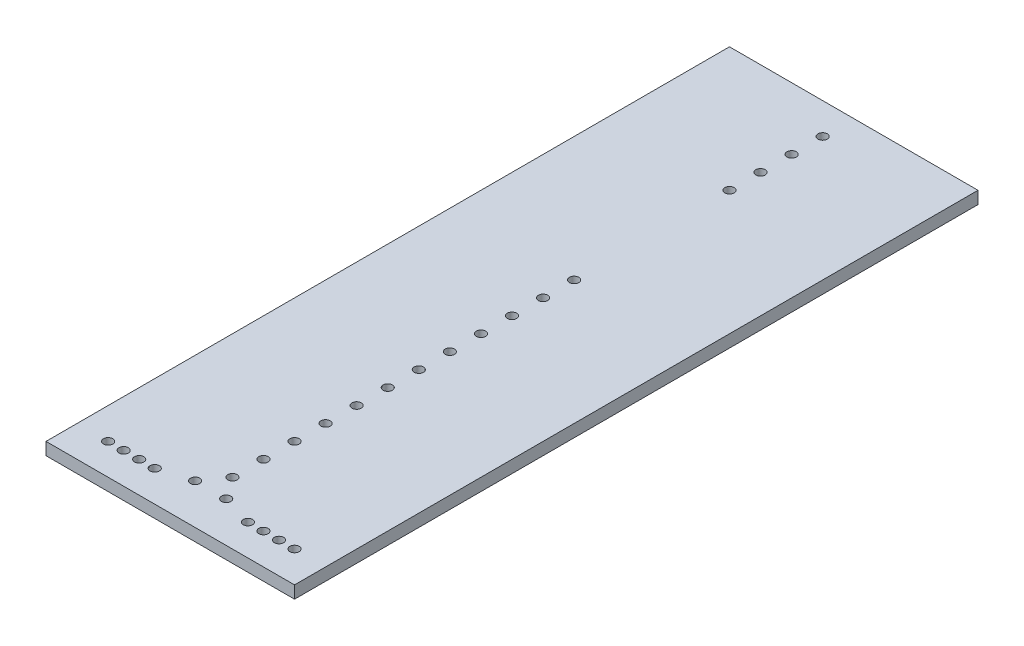
ISO-10303-21;
HEADER;
FILE_DESCRIPTION(('STEP AP214'),'2;1');
FILE_NAME('part.step','',(''),(''),'','','');
FILE_SCHEMA(('AUTOMOTIVE_DESIGN { 1 0 10303 214 1 1 1 1 }'));
ENDSEC;
DATA;
#1=APPLICATION_CONTEXT('core data for automotive mechanical design processes');
#2=APPLICATION_PROTOCOL_DEFINITION('international standard','automotive_design',2000,#1);
#3=PRODUCT_CONTEXT('',#1,'mechanical');
#4=PRODUCT('Part','Part','',(#3));
#5=PRODUCT_RELATED_PRODUCT_CATEGORY('part','',(#4));
#6=PRODUCT_DEFINITION_FORMATION('','',#4);
#7=PRODUCT_DEFINITION_CONTEXT('part definition',#1,'design');
#8=PRODUCT_DEFINITION('design','',#6,#7);
#9=PRODUCT_DEFINITION_SHAPE('','',#8);
#10=(LENGTH_UNIT() NAMED_UNIT(*) SI_UNIT(.MILLI.,.METRE.));
#11=(NAMED_UNIT(*) PLANE_ANGLE_UNIT() SI_UNIT($,.RADIAN.));
#12=(NAMED_UNIT(*) SI_UNIT($,.STERADIAN.) SOLID_ANGLE_UNIT());
#13=UNCERTAINTY_MEASURE_WITH_UNIT(LENGTH_MEASURE(1.E-05),#10,'distance_accuracy_value','');
#14=(GEOMETRIC_REPRESENTATION_CONTEXT(3) GLOBAL_UNCERTAINTY_ASSIGNED_CONTEXT((#13)) GLOBAL_UNIT_ASSIGNED_CONTEXT((#10,
#11,#12)) REPRESENTATION_CONTEXT('',''));
#15=CARTESIAN_POINT('',(0.,0.,0.));
#16=DIRECTION('',(0.,0.,1.));
#17=DIRECTION('',(1.,0.,0.));
#18=AXIS2_PLACEMENT_3D('',#15,#16,#17);
#19=CARTESIAN_POINT('',(40.,4.,110.));
#20=DIRECTION('',(-1.,0.,0.));
#21=DIRECTION('',(0.,0.,1.));
#22=AXIS2_PLACEMENT_3D('',#19,#20,#21);
#23=PLANE('',#22);
#24=DIRECTION('',(0.,0.,-1.));
#25=VECTOR('',#24,1.);
#26=CARTESIAN_POINT('',(40.,0.,110.));
#27=LINE('',#26,#25);
#28=CARTESIAN_POINT('',(40.,0.,110.));
#29=VERTEX_POINT('',#28);
#30=CARTESIAN_POINT('',(40.,0.,-110.));
#31=VERTEX_POINT('',#30);
#32=EDGE_CURVE('E96',#29,#31,#27,.T.);
#33=ORIENTED_EDGE('',*,*,#32,.T.);
#34=DIRECTION('',(0.,-1.,0.));
#35=VECTOR('',#34,1.);
#36=CARTESIAN_POINT('',(40.,4.,-110.));
#37=LINE('',#36,#35);
#38=CARTESIAN_POINT('',(40.,4.,-110.));
#39=VERTEX_POINT('',#38);
#40=EDGE_CURVE('E11',#39,#31,#37,.T.);
#41=ORIENTED_EDGE('',*,*,#40,.F.);
#42=DIRECTION('',(0.,0.,-1.));
#43=VECTOR('',#42,1.);
#44=CARTESIAN_POINT('',(40.,4.,110.));
#45=LINE('',#44,#43);
#46=CARTESIAN_POINT('',(40.,4.,110.));
#47=VERTEX_POINT('',#46);
#48=EDGE_CURVE('E84',#47,#39,#45,.T.);
#49=ORIENTED_EDGE('',*,*,#48,.F.);
#50=DIRECTION('',(0.,-1.,0.));
#51=VECTOR('',#50,1.);
#52=CARTESIAN_POINT('',(40.,4.,110.));
#53=LINE('',#52,#51);
#54=EDGE_CURVE('E92',#47,#29,#53,.T.);
#55=ORIENTED_EDGE('',*,*,#54,.T.);
#56=EDGE_LOOP('',(#33,#41,#49,#55));
#57=FACE_BOUND('',#56,.T.);
#58=ADVANCED_FACE('F33',(#57),#23,.F.);
#59=CARTESIAN_POINT('',(-40.,4.,-110.));
#60=DIRECTION('',(0.,0.,1.));
#61=DIRECTION('',(1.,0.,0.));
#62=AXIS2_PLACEMENT_3D('',#59,#60,#61);
#63=PLANE('',#62);
#64=DIRECTION('',(-1.,0.,0.));
#65=VECTOR('',#64,1.);
#66=CARTESIAN_POINT('',(-40.,0.,-110.));
#67=LINE('',#66,#65);
#68=CARTESIAN_POINT('',(-40.,0.,-110.));
#69=VERTEX_POINT('',#68);
#70=EDGE_CURVE('E88',#31,#69,#67,.T.);
#71=ORIENTED_EDGE('',*,*,#70,.T.);
#72=DIRECTION('',(0.,-1.,0.));
#73=VECTOR('',#72,1.);
#74=CARTESIAN_POINT('',(-40.,4.,-110.));
#75=LINE('',#74,#73);
#76=CARTESIAN_POINT('',(-40.,4.,-110.));
#77=VERTEX_POINT('',#76);
#78=EDGE_CURVE('E41',#77,#69,#75,.T.);
#79=ORIENTED_EDGE('',*,*,#78,.F.);
#80=DIRECTION('',(-1.,0.,0.));
#81=VECTOR('',#80,1.);
#82=CARTESIAN_POINT('',(-40.,4.,-110.));
#83=LINE('',#82,#81);
#84=EDGE_CURVE('E79',#39,#77,#83,.T.);
#85=ORIENTED_EDGE('',*,*,#84,.F.);
#86=ORIENTED_EDGE('',*,*,#40,.T.);
#87=EDGE_LOOP('',(#71,#79,#85,#86));
#88=FACE_BOUND('',#87,.T.);
#89=ADVANCED_FACE('F87',(#88),#63,.F.);
#90=CARTESIAN_POINT('',(-40.,4.,110.));
#91=DIRECTION('',(1.,0.,0.));
#92=DIRECTION('',(0.,0.,-1.));
#93=AXIS2_PLACEMENT_3D('',#90,#91,#92);
#94=PLANE('',#93);
#95=DIRECTION('',(0.,0.,1.));
#96=VECTOR('',#95,1.);
#97=CARTESIAN_POINT('',(-40.,0.,110.));
#98=LINE('',#97,#96);
#99=CARTESIAN_POINT('',(-40.,0.,110.));
#100=VERTEX_POINT('',#99);
#101=EDGE_CURVE('E66',#69,#100,#98,.T.);
#102=ORIENTED_EDGE('',*,*,#101,.T.);
#103=DIRECTION('',(0.,-1.,0.));
#104=VECTOR('',#103,1.);
#105=CARTESIAN_POINT('',(-40.,4.,110.));
#106=LINE('',#105,#104);
#107=CARTESIAN_POINT('',(-40.,4.,110.));
#108=VERTEX_POINT('',#107);
#109=EDGE_CURVE('E89',#108,#100,#106,.T.);
#110=ORIENTED_EDGE('',*,*,#109,.F.);
#111=DIRECTION('',(0.,0.,1.));
#112=VECTOR('',#111,1.);
#113=CARTESIAN_POINT('',(-40.,4.,110.));
#114=LINE('',#113,#112);
#115=EDGE_CURVE('E82',#77,#108,#114,.T.);
#116=ORIENTED_EDGE('',*,*,#115,.F.);
#117=ORIENTED_EDGE('',*,*,#78,.T.);
#118=EDGE_LOOP('',(#102,#110,#116,#117));
#119=FACE_BOUND('',#118,.T.);
#120=ADVANCED_FACE('F90',(#119),#94,.F.);
#121=CARTESIAN_POINT('',(-40.,4.,110.));
#122=DIRECTION('',(0.,0.,-1.));
#123=DIRECTION('',(-1.,0.,0.));
#124=AXIS2_PLACEMENT_3D('',#121,#122,#123);
#125=PLANE('',#124);
#126=DIRECTION('',(1.,0.,0.));
#127=VECTOR('',#126,1.);
#128=CARTESIAN_POINT('',(-40.,0.,110.));
#129=LINE('',#128,#127);
#130=EDGE_CURVE('E72',#100,#29,#129,.T.);
#131=ORIENTED_EDGE('',*,*,#130,.T.);
#132=ORIENTED_EDGE('',*,*,#54,.F.);
#133=DIRECTION('',(1.,0.,0.));
#134=VECTOR('',#133,1.);
#135=CARTESIAN_POINT('',(-40.,4.,110.));
#136=LINE('',#135,#134);
#137=EDGE_CURVE('E49',#108,#47,#136,.T.);
#138=ORIENTED_EDGE('',*,*,#137,.F.);
#139=ORIENTED_EDGE('',*,*,#109,.T.);
#140=EDGE_LOOP('',(#131,#132,#138,#139));
#141=FACE_BOUND('',#140,.T.);
#142=ADVANCED_FACE('F104',(#141),#125,.F.);
#143=CARTESIAN_POINT('',(0.,4.,0.));
#144=DIRECTION('',(0.,-1.,0.));
#145=DIRECTION('',(0.,0.,-1.));
#146=AXIS2_PLACEMENT_3D('',#143,#144,#145);
#147=PLANE('',#146);
#148=CARTESIAN_POINT('',(0.,4.,-70.));
#149=DIRECTION('',(0.,1.,0.));
#150=DIRECTION('',(0.,0.,1.));
#151=AXIS2_PLACEMENT_3D('',#148,#149,#150);
#152=CIRCLE('',#151,1.5);
#153=CARTESIAN_POINT('',(0.,4.,-68.5));
#154=VERTEX_POINT('',#153);
#155=EDGE_CURVE('E260',#154,#154,#152,.T.);
#156=ORIENTED_EDGE('',*,*,#155,.F.);
#157=EDGE_LOOP('',(#156));
#158=FACE_BOUND('',#157,.T.);
#159=CARTESIAN_POINT('',(0.,4.,-80.));
#160=DIRECTION('',(0.,1.,0.));
#161=DIRECTION('',(0.,0.,1.));
#162=AXIS2_PLACEMENT_3D('',#159,#160,#161);
#163=CIRCLE('',#162,1.5);
#164=CARTESIAN_POINT('',(0.,4.,-78.5));
#165=VERTEX_POINT('',#164);
#166=EDGE_CURVE('E254',#165,#165,#163,.T.);
#167=ORIENTED_EDGE('',*,*,#166,.F.);
#168=EDGE_LOOP('',(#167));
#169=FACE_BOUND('',#168,.T.);
#170=CARTESIAN_POINT('',(0.,4.,-90.));
#171=DIRECTION('',(0.,1.,0.));
#172=DIRECTION('',(0.,0.,1.));
#173=AXIS2_PLACEMENT_3D('',#170,#171,#172);
#174=CIRCLE('',#173,1.5);
#175=CARTESIAN_POINT('',(0.,4.,-88.5));
#176=VERTEX_POINT('',#175);
#177=EDGE_CURVE('E248',#176,#176,#174,.T.);
#178=ORIENTED_EDGE('',*,*,#177,.F.);
#179=EDGE_LOOP('',(#178));
#180=FACE_BOUND('',#179,.T.);
#181=CARTESIAN_POINT('',(0.,4.,-100.));
#182=DIRECTION('',(0.,1.,0.));
#183=DIRECTION('',(0.,0.,1.));
#184=AXIS2_PLACEMENT_3D('',#181,#182,#183);
#185=CIRCLE('',#184,1.5);
#186=CARTESIAN_POINT('',(0.,4.,-98.5));
#187=VERTEX_POINT('',#186);
#188=EDGE_CURVE('E242',#187,#187,#185,.T.);
#189=ORIENTED_EDGE('',*,*,#188,.F.);
#190=EDGE_LOOP('',(#189));
#191=FACE_BOUND('',#190,.T.);
#192=CARTESIAN_POINT('',(-5.00000000000003,4.,97.0000000000001));
#193=DIRECTION('',(0.,-1.,0.));
#194=DIRECTION('',(0.,0.,1.));
#195=AXIS2_PLACEMENT_3D('',#192,#193,#194);
#196=CIRCLE('',#195,1.5);
#197=CARTESIAN_POINT('',(-5.00000000000003,4.,98.5000000000001));
#198=VERTEX_POINT('',#197);
#199=EDGE_CURVE('E236',#198,#198,#196,.T.);
#200=ORIENTED_EDGE('',*,*,#199,.T.);
#201=EDGE_LOOP('',(#200));
#202=FACE_BOUND('',#201,.T.);
#203=CARTESIAN_POINT('',(5.00000000000003,4.,97.0000000000001));
#204=DIRECTION('',(0.,1.,0.));
#205=DIRECTION('',(0.,0.,1.));
#206=AXIS2_PLACEMENT_3D('',#203,#204,#205);
#207=CIRCLE('',#206,1.5);
#208=CARTESIAN_POINT('',(5.00000000000003,4.,98.5000000000001));
#209=VERTEX_POINT('',#208);
#210=EDGE_CURVE('E230',#209,#209,#207,.T.);
#211=ORIENTED_EDGE('',*,*,#210,.F.);
#212=EDGE_LOOP('',(#211));
#213=FACE_BOUND('',#212,.T.);
#214=CARTESIAN_POINT('',(0.,4.,90.));
#215=DIRECTION('',(0.,1.,0.));
#216=DIRECTION('',(0.,0.,1.));
#217=AXIS2_PLACEMENT_3D('',#214,#215,#216);
#218=CIRCLE('',#217,1.5);
#219=CARTESIAN_POINT('',(0.,4.,91.5));
#220=VERTEX_POINT('',#219);
#221=EDGE_CURVE('E225',#220,#220,#218,.T.);
#222=ORIENTED_EDGE('',*,*,#221,.F.);
#223=EDGE_LOOP('',(#222));
#224=FACE_BOUND('',#223,.T.);
#225=CARTESIAN_POINT('',(0.,4.,80.));
#226=DIRECTION('',(0.,1.,0.));
#227=DIRECTION('',(0.,0.,1.));
#228=AXIS2_PLACEMENT_3D('',#225,#226,#227);
#229=CIRCLE('',#228,1.5);
#230=CARTESIAN_POINT('',(0.,4.,81.5));
#231=VERTEX_POINT('',#230);
#232=EDGE_CURVE('E219',#231,#231,#229,.T.);
#233=ORIENTED_EDGE('',*,*,#232,.F.);
#234=EDGE_LOOP('',(#233));
#235=FACE_BOUND('',#234,.T.);
#236=CARTESIAN_POINT('',(0.,4.,70.));
#237=DIRECTION('',(0.,1.,0.));
#238=DIRECTION('',(0.,0.,1.));
#239=AXIS2_PLACEMENT_3D('',#236,#237,#238);
#240=CIRCLE('',#239,1.5);
#241=CARTESIAN_POINT('',(0.,4.,71.5));
#242=VERTEX_POINT('',#241);
#243=EDGE_CURVE('E213',#242,#242,#240,.T.);
#244=ORIENTED_EDGE('',*,*,#243,.F.);
#245=EDGE_LOOP('',(#244));
#246=FACE_BOUND('',#245,.T.);
#247=CARTESIAN_POINT('',(0.,4.,60.));
#248=DIRECTION('',(0.,1.,0.));
#249=DIRECTION('',(0.,0.,1.));
#250=AXIS2_PLACEMENT_3D('',#247,#248,#249);
#251=CIRCLE('',#250,1.5);
#252=CARTESIAN_POINT('',(0.,4.,61.5));
#253=VERTEX_POINT('',#252);
#254=EDGE_CURVE('E207',#253,#253,#251,.T.);
#255=ORIENTED_EDGE('',*,*,#254,.F.);
#256=EDGE_LOOP('',(#255));
#257=FACE_BOUND('',#256,.T.);
#258=CARTESIAN_POINT('',(0.,4.,50.));
#259=DIRECTION('',(0.,1.,0.));
#260=DIRECTION('',(0.,0.,1.));
#261=AXIS2_PLACEMENT_3D('',#258,#259,#260);
#262=CIRCLE('',#261,1.5);
#263=CARTESIAN_POINT('',(0.,4.,51.5));
#264=VERTEX_POINT('',#263);
#265=EDGE_CURVE('E201',#264,#264,#262,.T.);
#266=ORIENTED_EDGE('',*,*,#265,.F.);
#267=EDGE_LOOP('',(#266));
#268=FACE_BOUND('',#267,.T.);
#269=CARTESIAN_POINT('',(0.,4.,40.));
#270=DIRECTION('',(0.,1.,0.));
#271=DIRECTION('',(0.,0.,1.));
#272=AXIS2_PLACEMENT_3D('',#269,#270,#271);
#273=CIRCLE('',#272,1.5);
#274=CARTESIAN_POINT('',(0.,4.,41.5));
#275=VERTEX_POINT('',#274);
#276=EDGE_CURVE('E195',#275,#275,#273,.T.);
#277=ORIENTED_EDGE('',*,*,#276,.F.);
#278=EDGE_LOOP('',(#277));
#279=FACE_BOUND('',#278,.T.);
#280=CARTESIAN_POINT('',(0.,4.,30.));
#281=DIRECTION('',(0.,1.,0.));
#282=DIRECTION('',(0.,0.,1.));
#283=AXIS2_PLACEMENT_3D('',#280,#281,#282);
#284=CIRCLE('',#283,1.5);
#285=CARTESIAN_POINT('',(0.,4.,31.5));
#286=VERTEX_POINT('',#285);
#287=EDGE_CURVE('E189',#286,#286,#284,.T.);
#288=ORIENTED_EDGE('',*,*,#287,.F.);
#289=EDGE_LOOP('',(#288));
#290=FACE_BOUND('',#289,.T.);
#291=CARTESIAN_POINT('',(0.,4.,20.));
#292=DIRECTION('',(0.,1.,0.));
#293=DIRECTION('',(0.,0.,1.));
#294=AXIS2_PLACEMENT_3D('',#291,#292,#293);
#295=CIRCLE('',#294,1.5);
#296=CARTESIAN_POINT('',(0.,4.,21.5));
#297=VERTEX_POINT('',#296);
#298=EDGE_CURVE('E183',#297,#297,#295,.T.);
#299=ORIENTED_EDGE('',*,*,#298,.F.);
#300=EDGE_LOOP('',(#299));
#301=FACE_BOUND('',#300,.T.);
#302=CARTESIAN_POINT('',(0.,4.,9.99999999999999));
#303=DIRECTION('',(0.,1.,0.));
#304=DIRECTION('',(0.,0.,1.));
#305=AXIS2_PLACEMENT_3D('',#302,#303,#304);
#306=CIRCLE('',#305,1.5);
#307=CARTESIAN_POINT('',(0.,4.,11.5));
#308=VERTEX_POINT('',#307);
#309=EDGE_CURVE('E177',#308,#308,#306,.T.);
#310=ORIENTED_EDGE('',*,*,#309,.F.);
#311=EDGE_LOOP('',(#310));
#312=FACE_BOUND('',#311,.T.);
#313=CARTESIAN_POINT('',(0.,4.,0.));
#314=DIRECTION('',(0.,1.,0.));
#315=DIRECTION('',(0.,0.,1.));
#316=AXIS2_PLACEMENT_3D('',#313,#314,#315);
#317=CIRCLE('',#316,1.5);
#318=CARTESIAN_POINT('',(0.,4.,1.5));
#319=VERTEX_POINT('',#318);
#320=EDGE_CURVE('E171',#319,#319,#317,.T.);
#321=ORIENTED_EDGE('',*,*,#320,.F.);
#322=EDGE_LOOP('',(#321));
#323=FACE_BOUND('',#322,.T.);
#324=CARTESIAN_POINT('',(0.,4.,-10.));
#325=DIRECTION('',(0.,1.,0.));
#326=DIRECTION('',(0.,0.,1.));
#327=AXIS2_PLACEMENT_3D('',#324,#325,#326);
#328=CIRCLE('',#327,1.5);
#329=CARTESIAN_POINT('',(0.,4.,-8.50000000000001));
#330=VERTEX_POINT('',#329);
#331=EDGE_CURVE('E165',#330,#330,#328,.T.);
#332=ORIENTED_EDGE('',*,*,#331,.F.);
#333=EDGE_LOOP('',(#332));
#334=FACE_BOUND('',#333,.T.);
#335=CARTESIAN_POINT('',(0.,4.,-20.));
#336=DIRECTION('',(0.,1.,0.));
#337=DIRECTION('',(0.,0.,1.));
#338=AXIS2_PLACEMENT_3D('',#335,#336,#337);
#339=CIRCLE('',#338,1.5);
#340=CARTESIAN_POINT('',(0.,4.,-18.5));
#341=VERTEX_POINT('',#340);
#342=EDGE_CURVE('E158',#341,#341,#339,.T.);
#343=ORIENTED_EDGE('',*,*,#342,.F.);
#344=EDGE_LOOP('',(#343));
#345=FACE_BOUND('',#344,.T.);
#346=CARTESIAN_POINT('',(-30.,4.,100.));
#347=DIRECTION('',(0.,-1.,0.));
#348=DIRECTION('',(0.,0.,1.));
#349=AXIS2_PLACEMENT_3D('',#346,#347,#348);
#350=CIRCLE('',#349,1.5);
#351=CARTESIAN_POINT('',(-30.,4.,101.5));
#352=VERTEX_POINT('',#351);
#353=EDGE_CURVE('E153',#352,#352,#350,.T.);
#354=ORIENTED_EDGE('',*,*,#353,.T.);
#355=EDGE_LOOP('',(#354));
#356=FACE_BOUND('',#355,.T.);
#357=CARTESIAN_POINT('',(-25.,4.,100.));
#358=DIRECTION('',(0.,-1.,0.));
#359=DIRECTION('',(0.,0.,1.));
#360=AXIS2_PLACEMENT_3D('',#357,#358,#359);
#361=CIRCLE('',#360,1.5);
#362=CARTESIAN_POINT('',(-25.,4.,101.5));
#363=VERTEX_POINT('',#362);
#364=EDGE_CURVE('E147',#363,#363,#361,.T.);
#365=ORIENTED_EDGE('',*,*,#364,.T.);
#366=EDGE_LOOP('',(#365));
#367=FACE_BOUND('',#366,.T.);
#368=CARTESIAN_POINT('',(-20.,4.,100.));
#369=DIRECTION('',(0.,-1.,0.));
#370=DIRECTION('',(0.,0.,1.));
#371=AXIS2_PLACEMENT_3D('',#368,#369,#370);
#372=CIRCLE('',#371,1.5);
#373=CARTESIAN_POINT('',(-20.,4.,101.5));
#374=VERTEX_POINT('',#373);
#375=EDGE_CURVE('E141',#374,#374,#372,.T.);
#376=ORIENTED_EDGE('',*,*,#375,.T.);
#377=EDGE_LOOP('',(#376));
#378=FACE_BOUND('',#377,.T.);
#379=CARTESIAN_POINT('',(-15.,4.,100.));
#380=DIRECTION('',(0.,-1.,0.));
#381=DIRECTION('',(0.,0.,1.));
#382=AXIS2_PLACEMENT_3D('',#379,#380,#381);
#383=CIRCLE('',#382,1.5);
#384=CARTESIAN_POINT('',(-15.,4.,101.5));
#385=VERTEX_POINT('',#384);
#386=EDGE_CURVE('E134',#385,#385,#383,.T.);
#387=ORIENTED_EDGE('',*,*,#386,.T.);
#388=EDGE_LOOP('',(#387));
#389=FACE_BOUND('',#388,.T.);
#390=CARTESIAN_POINT('',(30.,4.,100.));
#391=DIRECTION('',(0.,1.,0.));
#392=DIRECTION('',(0.,0.,1.));
#393=AXIS2_PLACEMENT_3D('',#390,#391,#392);
#394=CIRCLE('',#393,1.5);
#395=CARTESIAN_POINT('',(30.,4.,101.5));
#396=VERTEX_POINT('',#395);
#397=EDGE_CURVE('E129',#396,#396,#394,.T.);
#398=ORIENTED_EDGE('',*,*,#397,.F.);
#399=EDGE_LOOP('',(#398));
#400=FACE_BOUND('',#399,.T.);
#401=CARTESIAN_POINT('',(25.,4.,100.));
#402=DIRECTION('',(0.,1.,0.));
#403=DIRECTION('',(0.,0.,1.));
#404=AXIS2_PLACEMENT_3D('',#401,#402,#403);
#405=CIRCLE('',#404,1.5);
#406=CARTESIAN_POINT('',(25.,4.,101.5));
#407=VERTEX_POINT('',#406);
#408=EDGE_CURVE('E123',#407,#407,#405,.T.);
#409=ORIENTED_EDGE('',*,*,#408,.F.);
#410=EDGE_LOOP('',(#409));
#411=FACE_BOUND('',#410,.T.);
#412=CARTESIAN_POINT('',(20.,4.,100.));
#413=DIRECTION('',(0.,1.,0.));
#414=DIRECTION('',(0.,0.,1.));
#415=AXIS2_PLACEMENT_3D('',#412,#413,#414);
#416=CIRCLE('',#415,1.5);
#417=CARTESIAN_POINT('',(20.,4.,101.5));
#418=VERTEX_POINT('',#417);
#419=EDGE_CURVE('E117',#418,#418,#416,.T.);
#420=ORIENTED_EDGE('',*,*,#419,.F.);
#421=EDGE_LOOP('',(#420));
#422=FACE_BOUND('',#421,.T.);
#423=CARTESIAN_POINT('',(15.,4.,100.));
#424=DIRECTION('',(0.,1.,0.));
#425=DIRECTION('',(0.,0.,1.));
#426=AXIS2_PLACEMENT_3D('',#423,#424,#425);
#427=CIRCLE('',#426,1.5);
#428=CARTESIAN_POINT('',(15.,4.,101.5));
#429=VERTEX_POINT('',#428);
#430=EDGE_CURVE('E110',#429,#429,#427,.T.);
#431=ORIENTED_EDGE('',*,*,#430,.F.);
#432=EDGE_LOOP('',(#431));
#433=FACE_BOUND('',#432,.T.);
#434=ORIENTED_EDGE('',*,*,#48,.T.);
#435=ORIENTED_EDGE('',*,*,#84,.T.);
#436=ORIENTED_EDGE('',*,*,#115,.T.);
#437=ORIENTED_EDGE('',*,*,#137,.T.);
#438=EDGE_LOOP('',(#434,#435,#436,#437));
#439=FACE_BOUND('',#438,.T.);
#440=ADVANCED_FACE('F80',(#158,#169,#180,#191,#202,#213,#224,#235,#246,#257,#268,#279,#290,#301,
#312,#323,#334,#345,#356,#367,#378,#389,#400,#411,#422,#433,#439),#147,.F.);
#441=CARTESIAN_POINT('',(0.,0.,0.));
#442=DIRECTION('',(0.,-1.,0.));
#443=DIRECTION('',(0.,0.,-1.));
#444=AXIS2_PLACEMENT_3D('',#441,#442,#443);
#445=PLANE('',#444);
#446=CARTESIAN_POINT('',(0.,0.,-70.));
#447=DIRECTION('',(0.,1.,0.));
#448=DIRECTION('',(0.,0.,1.));
#449=AXIS2_PLACEMENT_3D('',#446,#447,#448);
#450=CIRCLE('',#449,1.5);
#451=CARTESIAN_POINT('',(0.,0.,-68.5));
#452=VERTEX_POINT('',#451);
#453=EDGE_CURVE('E239',#452,#452,#450,.T.);
#454=ORIENTED_EDGE('',*,*,#453,.T.);
#455=EDGE_LOOP('',(#454));
#456=FACE_BOUND('',#455,.T.);
#457=CARTESIAN_POINT('',(0.,0.,-80.));
#458=DIRECTION('',(0.,1.,0.));
#459=DIRECTION('',(0.,0.,1.));
#460=AXIS2_PLACEMENT_3D('',#457,#458,#459);
#461=CIRCLE('',#460,1.5);
#462=CARTESIAN_POINT('',(0.,0.,-78.5));
#463=VERTEX_POINT('',#462);
#464=EDGE_CURVE('E257',#463,#463,#461,.T.);
#465=ORIENTED_EDGE('',*,*,#464,.T.);
#466=EDGE_LOOP('',(#465));
#467=FACE_BOUND('',#466,.T.);
#468=CARTESIAN_POINT('',(0.,0.,-90.));
#469=DIRECTION('',(0.,1.,0.));
#470=DIRECTION('',(0.,0.,1.));
#471=AXIS2_PLACEMENT_3D('',#468,#469,#470);
#472=CIRCLE('',#471,1.5);
#473=CARTESIAN_POINT('',(0.,0.,-88.5));
#474=VERTEX_POINT('',#473);
#475=EDGE_CURVE('E251',#474,#474,#472,.T.);
#476=ORIENTED_EDGE('',*,*,#475,.T.);
#477=EDGE_LOOP('',(#476));
#478=FACE_BOUND('',#477,.T.);
#479=CARTESIAN_POINT('',(0.,0.,-100.));
#480=DIRECTION('',(0.,1.,0.));
#481=DIRECTION('',(0.,0.,1.));
#482=AXIS2_PLACEMENT_3D('',#479,#480,#481);
#483=CIRCLE('',#482,1.5);
#484=CARTESIAN_POINT('',(0.,0.,-98.5));
#485=VERTEX_POINT('',#484);
#486=EDGE_CURVE('E245',#485,#485,#483,.T.);
#487=ORIENTED_EDGE('',*,*,#486,.T.);
#488=EDGE_LOOP('',(#487));
#489=FACE_BOUND('',#488,.T.);
#490=CARTESIAN_POINT('',(-5.00000000000003,0.,97.0000000000001));
#491=DIRECTION('',(0.,-1.,0.));
#492=DIRECTION('',(0.,0.,1.));
#493=AXIS2_PLACEMENT_3D('',#490,#491,#492);
#494=CIRCLE('',#493,1.5);
#495=CARTESIAN_POINT('',(-5.00000000000003,0.,98.5000000000001));
#496=VERTEX_POINT('',#495);
#497=EDGE_CURVE('E233',#496,#496,#494,.T.);
#498=ORIENTED_EDGE('',*,*,#497,.F.);
#499=EDGE_LOOP('',(#498));
#500=FACE_BOUND('',#499,.T.);
#501=CARTESIAN_POINT('',(5.00000000000003,0.,97.0000000000001));
#502=DIRECTION('',(0.,1.,0.));
#503=DIRECTION('',(0.,0.,1.));
#504=AXIS2_PLACEMENT_3D('',#501,#502,#503);
#505=CIRCLE('',#504,1.5);
#506=CARTESIAN_POINT('',(5.00000000000003,0.,98.5000000000001));
#507=VERTEX_POINT('',#506);
#508=EDGE_CURVE('E162',#507,#507,#505,.T.);
#509=ORIENTED_EDGE('',*,*,#508,.T.);
#510=EDGE_LOOP('',(#509));
#511=FACE_BOUND('',#510,.T.);
#512=CARTESIAN_POINT('',(0.,0.,90.));
#513=DIRECTION('',(0.,1.,0.));
#514=DIRECTION('',(0.,0.,1.));
#515=AXIS2_PLACEMENT_3D('',#512,#513,#514);
#516=CIRCLE('',#515,1.5);
#517=CARTESIAN_POINT('',(0.,0.,91.5));
#518=VERTEX_POINT('',#517);
#519=EDGE_CURVE('E138',#518,#518,#516,.T.);
#520=ORIENTED_EDGE('',*,*,#519,.T.);
#521=EDGE_LOOP('',(#520));
#522=FACE_BOUND('',#521,.T.);
#523=CARTESIAN_POINT('',(0.,0.,80.));
#524=DIRECTION('',(0.,1.,0.));
#525=DIRECTION('',(0.,0.,1.));
#526=AXIS2_PLACEMENT_3D('',#523,#524,#525);
#527=CIRCLE('',#526,1.5);
#528=CARTESIAN_POINT('',(0.,0.,81.5));
#529=VERTEX_POINT('',#528);
#530=EDGE_CURVE('E222',#529,#529,#527,.T.);
#531=ORIENTED_EDGE('',*,*,#530,.T.);
#532=EDGE_LOOP('',(#531));
#533=FACE_BOUND('',#532,.T.);
#534=CARTESIAN_POINT('',(0.,0.,70.));
#535=DIRECTION('',(0.,1.,0.));
#536=DIRECTION('',(0.,0.,1.));
#537=AXIS2_PLACEMENT_3D('',#534,#535,#536);
#538=CIRCLE('',#537,1.5);
#539=CARTESIAN_POINT('',(0.,0.,71.5));
#540=VERTEX_POINT('',#539);
#541=EDGE_CURVE('E216',#540,#540,#538,.T.);
#542=ORIENTED_EDGE('',*,*,#541,.T.);
#543=EDGE_LOOP('',(#542));
#544=FACE_BOUND('',#543,.T.);
#545=CARTESIAN_POINT('',(0.,0.,60.));
#546=DIRECTION('',(0.,1.,0.));
#547=DIRECTION('',(0.,0.,1.));
#548=AXIS2_PLACEMENT_3D('',#545,#546,#547);
#549=CIRCLE('',#548,1.5);
#550=CARTESIAN_POINT('',(0.,0.,61.5));
#551=VERTEX_POINT('',#550);
#552=EDGE_CURVE('E210',#551,#551,#549,.T.);
#553=ORIENTED_EDGE('',*,*,#552,.T.);
#554=EDGE_LOOP('',(#553));
#555=FACE_BOUND('',#554,.T.);
#556=CARTESIAN_POINT('',(0.,0.,50.));
#557=DIRECTION('',(0.,1.,0.));
#558=DIRECTION('',(0.,0.,1.));
#559=AXIS2_PLACEMENT_3D('',#556,#557,#558);
#560=CIRCLE('',#559,1.5);
#561=CARTESIAN_POINT('',(0.,0.,51.5));
#562=VERTEX_POINT('',#561);
#563=EDGE_CURVE('E204',#562,#562,#560,.T.);
#564=ORIENTED_EDGE('',*,*,#563,.T.);
#565=EDGE_LOOP('',(#564));
#566=FACE_BOUND('',#565,.T.);
#567=CARTESIAN_POINT('',(0.,0.,40.));
#568=DIRECTION('',(0.,1.,0.));
#569=DIRECTION('',(0.,0.,1.));
#570=AXIS2_PLACEMENT_3D('',#567,#568,#569);
#571=CIRCLE('',#570,1.5);
#572=CARTESIAN_POINT('',(0.,0.,41.5));
#573=VERTEX_POINT('',#572);
#574=EDGE_CURVE('E198',#573,#573,#571,.T.);
#575=ORIENTED_EDGE('',*,*,#574,.T.);
#576=EDGE_LOOP('',(#575));
#577=FACE_BOUND('',#576,.T.);
#578=CARTESIAN_POINT('',(0.,0.,30.));
#579=DIRECTION('',(0.,1.,0.));
#580=DIRECTION('',(0.,0.,1.));
#581=AXIS2_PLACEMENT_3D('',#578,#579,#580);
#582=CIRCLE('',#581,1.5);
#583=CARTESIAN_POINT('',(0.,0.,31.5));
#584=VERTEX_POINT('',#583);
#585=EDGE_CURVE('E192',#584,#584,#582,.T.);
#586=ORIENTED_EDGE('',*,*,#585,.T.);
#587=EDGE_LOOP('',(#586));
#588=FACE_BOUND('',#587,.T.);
#589=CARTESIAN_POINT('',(0.,0.,20.));
#590=DIRECTION('',(0.,1.,0.));
#591=DIRECTION('',(0.,0.,1.));
#592=AXIS2_PLACEMENT_3D('',#589,#590,#591);
#593=CIRCLE('',#592,1.5);
#594=CARTESIAN_POINT('',(0.,0.,21.5));
#595=VERTEX_POINT('',#594);
#596=EDGE_CURVE('E186',#595,#595,#593,.T.);
#597=ORIENTED_EDGE('',*,*,#596,.T.);
#598=EDGE_LOOP('',(#597));
#599=FACE_BOUND('',#598,.T.);
#600=CARTESIAN_POINT('',(0.,0.,9.99999999999999));
#601=DIRECTION('',(0.,1.,0.));
#602=DIRECTION('',(0.,0.,1.));
#603=AXIS2_PLACEMENT_3D('',#600,#601,#602);
#604=CIRCLE('',#603,1.5);
#605=CARTESIAN_POINT('',(0.,0.,11.5));
#606=VERTEX_POINT('',#605);
#607=EDGE_CURVE('E180',#606,#606,#604,.T.);
#608=ORIENTED_EDGE('',*,*,#607,.T.);
#609=EDGE_LOOP('',(#608));
#610=FACE_BOUND('',#609,.T.);
#611=CARTESIAN_POINT('',(0.,0.,0.));
#612=DIRECTION('',(0.,1.,0.));
#613=DIRECTION('',(0.,0.,1.));
#614=AXIS2_PLACEMENT_3D('',#611,#612,#613);
#615=CIRCLE('',#614,1.5);
#616=CARTESIAN_POINT('',(0.,0.,1.5));
#617=VERTEX_POINT('',#616);
#618=EDGE_CURVE('E174',#617,#617,#615,.T.);
#619=ORIENTED_EDGE('',*,*,#618,.T.);
#620=EDGE_LOOP('',(#619));
#621=FACE_BOUND('',#620,.T.);
#622=CARTESIAN_POINT('',(0.,0.,-10.));
#623=DIRECTION('',(0.,1.,0.));
#624=DIRECTION('',(0.,0.,1.));
#625=AXIS2_PLACEMENT_3D('',#622,#623,#624);
#626=CIRCLE('',#625,1.5);
#627=CARTESIAN_POINT('',(0.,0.,-8.50000000000001));
#628=VERTEX_POINT('',#627);
#629=EDGE_CURVE('E168',#628,#628,#626,.T.);
#630=ORIENTED_EDGE('',*,*,#629,.T.);
#631=EDGE_LOOP('',(#630));
#632=FACE_BOUND('',#631,.T.);
#633=CARTESIAN_POINT('',(0.,0.,-20.));
#634=DIRECTION('',(0.,1.,0.));
#635=DIRECTION('',(0.,0.,1.));
#636=AXIS2_PLACEMENT_3D('',#633,#634,#635);
#637=CIRCLE('',#636,1.5);
#638=CARTESIAN_POINT('',(0.,0.,-18.5));
#639=VERTEX_POINT('',#638);
#640=EDGE_CURVE('E161',#639,#639,#637,.T.);
#641=ORIENTED_EDGE('',*,*,#640,.T.);
#642=EDGE_LOOP('',(#641));
#643=FACE_BOUND('',#642,.T.);
#644=CARTESIAN_POINT('',(-30.,0.,100.));
#645=DIRECTION('',(0.,-1.,0.));
#646=DIRECTION('',(0.,0.,1.));
#647=AXIS2_PLACEMENT_3D('',#644,#645,#646);
#648=CIRCLE('',#647,1.5);
#649=CARTESIAN_POINT('',(-30.,0.,101.5));
#650=VERTEX_POINT('',#649);
#651=EDGE_CURVE('E114',#650,#650,#648,.T.);
#652=ORIENTED_EDGE('',*,*,#651,.F.);
#653=EDGE_LOOP('',(#652));
#654=FACE_BOUND('',#653,.T.);
#655=CARTESIAN_POINT('',(-25.,0.,100.));
#656=DIRECTION('',(0.,-1.,0.));
#657=DIRECTION('',(0.,0.,1.));
#658=AXIS2_PLACEMENT_3D('',#655,#656,#657);
#659=CIRCLE('',#658,1.5);
#660=CARTESIAN_POINT('',(-25.,0.,101.5));
#661=VERTEX_POINT('',#660);
#662=EDGE_CURVE('E150',#661,#661,#659,.T.);
#663=ORIENTED_EDGE('',*,*,#662,.F.);
#664=EDGE_LOOP('',(#663));
#665=FACE_BOUND('',#664,.T.);
#666=CARTESIAN_POINT('',(-20.,0.,100.));
#667=DIRECTION('',(0.,-1.,0.));
#668=DIRECTION('',(0.,0.,1.));
#669=AXIS2_PLACEMENT_3D('',#666,#667,#668);
#670=CIRCLE('',#669,1.5);
#671=CARTESIAN_POINT('',(-20.,0.,101.5));
#672=VERTEX_POINT('',#671);
#673=EDGE_CURVE('E144',#672,#672,#670,.T.);
#674=ORIENTED_EDGE('',*,*,#673,.F.);
#675=EDGE_LOOP('',(#674));
#676=FACE_BOUND('',#675,.T.);
#677=CARTESIAN_POINT('',(-15.,0.,100.));
#678=DIRECTION('',(0.,-1.,0.));
#679=DIRECTION('',(0.,0.,1.));
#680=AXIS2_PLACEMENT_3D('',#677,#678,#679);
#681=CIRCLE('',#680,1.5);
#682=CARTESIAN_POINT('',(-15.,0.,101.5));
#683=VERTEX_POINT('',#682);
#684=EDGE_CURVE('E137',#683,#683,#681,.T.);
#685=ORIENTED_EDGE('',*,*,#684,.F.);
#686=EDGE_LOOP('',(#685));
#687=FACE_BOUND('',#686,.T.);
#688=CARTESIAN_POINT('',(30.,0.,100.));
#689=DIRECTION('',(0.,1.,0.));
#690=DIRECTION('',(0.,0.,1.));
#691=AXIS2_PLACEMENT_3D('',#688,#689,#690);
#692=CIRCLE('',#691,1.5);
#693=CARTESIAN_POINT('',(30.,0.,101.5));
#694=VERTEX_POINT('',#693);
#695=EDGE_CURVE('E99',#694,#694,#692,.T.);
#696=ORIENTED_EDGE('',*,*,#695,.T.);
#697=EDGE_LOOP('',(#696));
#698=FACE_BOUND('',#697,.T.);
#699=CARTESIAN_POINT('',(25.,0.,100.));
#700=DIRECTION('',(0.,1.,0.));
#701=DIRECTION('',(0.,0.,1.));
#702=AXIS2_PLACEMENT_3D('',#699,#700,#701);
#703=CIRCLE('',#702,1.5);
#704=CARTESIAN_POINT('',(25.,0.,101.5));
#705=VERTEX_POINT('',#704);
#706=EDGE_CURVE('E126',#705,#705,#703,.T.);
#707=ORIENTED_EDGE('',*,*,#706,.T.);
#708=EDGE_LOOP('',(#707));
#709=FACE_BOUND('',#708,.T.);
#710=CARTESIAN_POINT('',(20.,0.,100.));
#711=DIRECTION('',(0.,1.,0.));
#712=DIRECTION('',(0.,0.,1.));
#713=AXIS2_PLACEMENT_3D('',#710,#711,#712);
#714=CIRCLE('',#713,1.5);
#715=CARTESIAN_POINT('',(20.,0.,101.5));
#716=VERTEX_POINT('',#715);
#717=EDGE_CURVE('E120',#716,#716,#714,.T.);
#718=ORIENTED_EDGE('',*,*,#717,.T.);
#719=EDGE_LOOP('',(#718));
#720=FACE_BOUND('',#719,.T.);
#721=CARTESIAN_POINT('',(15.,0.,100.));
#722=DIRECTION('',(0.,1.,0.));
#723=DIRECTION('',(0.,0.,1.));
#724=AXIS2_PLACEMENT_3D('',#721,#722,#723);
#725=CIRCLE('',#724,1.5);
#726=CARTESIAN_POINT('',(15.,0.,101.5));
#727=VERTEX_POINT('',#726);
#728=EDGE_CURVE('E113',#727,#727,#725,.T.);
#729=ORIENTED_EDGE('',*,*,#728,.T.);
#730=EDGE_LOOP('',(#729));
#731=FACE_BOUND('',#730,.T.);
#732=ORIENTED_EDGE('',*,*,#32,.F.);
#733=ORIENTED_EDGE('',*,*,#130,.F.);
#734=ORIENTED_EDGE('',*,*,#101,.F.);
#735=ORIENTED_EDGE('',*,*,#70,.F.);
#736=EDGE_LOOP('',(#732,#733,#734,#735));
#737=FACE_BOUND('',#736,.T.);
#738=ADVANCED_FACE('F107',(#456,#467,#478,#489,#500,#511,#522,#533,#544,#555,#566,#577,#588,
#599,#610,#621,#632,#643,#654,#665,#676,#687,#698,#709,#720,#731,#737),#445,.T.);
#739=CARTESIAN_POINT('',(15.,0.,100.));
#740=DIRECTION('',(0.,1.,0.));
#741=DIRECTION('',(0.,0.,1.));
#742=AXIS2_PLACEMENT_3D('',#739,#740,#741);
#743=CYLINDRICAL_SURFACE('',#742,1.5);
#744=ORIENTED_EDGE('',*,*,#728,.F.);
#745=EDGE_LOOP('',(#744));
#746=FACE_BOUND('',#745,.T.);
#747=ORIENTED_EDGE('',*,*,#430,.T.);
#748=EDGE_LOOP('',(#747));
#749=FACE_BOUND('',#748,.T.);
#750=ADVANCED_FACE('F328',(#746,#749),#743,.F.);
#751=CARTESIAN_POINT('',(20.,0.,100.));
#752=DIRECTION('',(0.,1.,0.));
#753=DIRECTION('',(0.,0.,1.));
#754=AXIS2_PLACEMENT_3D('',#751,#752,#753);
#755=CYLINDRICAL_SURFACE('',#754,1.5);
#756=ORIENTED_EDGE('',*,*,#717,.F.);
#757=EDGE_LOOP('',(#756));
#758=FACE_BOUND('',#757,.T.);
#759=ORIENTED_EDGE('',*,*,#419,.T.);
#760=EDGE_LOOP('',(#759));
#761=FACE_BOUND('',#760,.T.);
#762=ADVANCED_FACE('F330',(#758,#761),#755,.F.);
#763=CARTESIAN_POINT('',(25.,0.,100.));
#764=DIRECTION('',(0.,1.,0.));
#765=DIRECTION('',(0.,0.,1.));
#766=AXIS2_PLACEMENT_3D('',#763,#764,#765);
#767=CYLINDRICAL_SURFACE('',#766,1.5);
#768=ORIENTED_EDGE('',*,*,#706,.F.);
#769=EDGE_LOOP('',(#768));
#770=FACE_BOUND('',#769,.T.);
#771=ORIENTED_EDGE('',*,*,#408,.T.);
#772=EDGE_LOOP('',(#771));
#773=FACE_BOUND('',#772,.T.);
#774=ADVANCED_FACE('F337',(#770,#773),#767,.F.);
#775=CARTESIAN_POINT('',(30.,0.,100.));
#776=DIRECTION('',(0.,1.,0.));
#777=DIRECTION('',(0.,0.,1.));
#778=AXIS2_PLACEMENT_3D('',#775,#776,#777);
#779=CYLINDRICAL_SURFACE('',#778,1.5);
#780=ORIENTED_EDGE('',*,*,#695,.F.);
#781=EDGE_LOOP('',(#780));
#782=FACE_BOUND('',#781,.T.);
#783=ORIENTED_EDGE('',*,*,#397,.T.);
#784=EDGE_LOOP('',(#783));
#785=FACE_BOUND('',#784,.T.);
#786=ADVANCED_FACE('F480',(#782,#785),#779,.F.);
#787=CARTESIAN_POINT('',(-15.,0.,100.));
#788=DIRECTION('',(0.,1.,0.));
#789=DIRECTION('',(0.,0.,1.));
#790=AXIS2_PLACEMENT_3D('',#787,#788,#789);
#791=CYLINDRICAL_SURFACE('',#790,1.5);
#792=ORIENTED_EDGE('',*,*,#684,.T.);
#793=EDGE_LOOP('',(#792));
#794=FACE_BOUND('',#793,.T.);
#795=ORIENTED_EDGE('',*,*,#386,.F.);
#796=EDGE_LOOP('',(#795));
#797=FACE_BOUND('',#796,.T.);
#798=ADVANCED_FACE('F476',(#794,#797),#791,.F.);
#799=CARTESIAN_POINT('',(-20.,0.,100.));
#800=DIRECTION('',(0.,1.,0.));
#801=DIRECTION('',(0.,0.,1.));
#802=AXIS2_PLACEMENT_3D('',#799,#800,#801);
#803=CYLINDRICAL_SURFACE('',#802,1.5);
#804=ORIENTED_EDGE('',*,*,#673,.T.);
#805=EDGE_LOOP('',(#804));
#806=FACE_BOUND('',#805,.T.);
#807=ORIENTED_EDGE('',*,*,#375,.F.);
#808=EDGE_LOOP('',(#807));
#809=FACE_BOUND('',#808,.T.);
#810=ADVANCED_FACE('F472',(#806,#809),#803,.F.);
#811=CARTESIAN_POINT('',(-25.,0.,100.));
#812=DIRECTION('',(0.,1.,0.));
#813=DIRECTION('',(0.,0.,1.));
#814=AXIS2_PLACEMENT_3D('',#811,#812,#813);
#815=CYLINDRICAL_SURFACE('',#814,1.5);
#816=ORIENTED_EDGE('',*,*,#662,.T.);
#817=EDGE_LOOP('',(#816));
#818=FACE_BOUND('',#817,.T.);
#819=ORIENTED_EDGE('',*,*,#364,.F.);
#820=EDGE_LOOP('',(#819));
#821=FACE_BOUND('',#820,.T.);
#822=ADVANCED_FACE('F468',(#818,#821),#815,.F.);
#823=CARTESIAN_POINT('',(-30.,0.,100.));
#824=DIRECTION('',(0.,1.,0.));
#825=DIRECTION('',(0.,0.,1.));
#826=AXIS2_PLACEMENT_3D('',#823,#824,#825);
#827=CYLINDRICAL_SURFACE('',#826,1.5);
#828=ORIENTED_EDGE('',*,*,#651,.T.);
#829=EDGE_LOOP('',(#828));
#830=FACE_BOUND('',#829,.T.);
#831=ORIENTED_EDGE('',*,*,#353,.F.);
#832=EDGE_LOOP('',(#831));
#833=FACE_BOUND('',#832,.T.);
#834=ADVANCED_FACE('F464',(#830,#833),#827,.F.);
#835=CARTESIAN_POINT('',(0.,0.,-20.));
#836=DIRECTION('',(0.,1.,0.));
#837=DIRECTION('',(0.,0.,1.));
#838=AXIS2_PLACEMENT_3D('',#835,#836,#837);
#839=CYLINDRICAL_SURFACE('',#838,1.5);
#840=ORIENTED_EDGE('',*,*,#640,.F.);
#841=EDGE_LOOP('',(#840));
#842=FACE_BOUND('',#841,.T.);
#843=ORIENTED_EDGE('',*,*,#342,.T.);
#844=EDGE_LOOP('',(#843));
#845=FACE_BOUND('',#844,.T.);
#846=ADVANCED_FACE('F460',(#842,#845),#839,.F.);
#847=CARTESIAN_POINT('',(0.,0.,-10.));
#848=DIRECTION('',(0.,1.,0.));
#849=DIRECTION('',(0.,0.,1.));
#850=AXIS2_PLACEMENT_3D('',#847,#848,#849);
#851=CYLINDRICAL_SURFACE('',#850,1.5);
#852=ORIENTED_EDGE('',*,*,#629,.F.);
#853=EDGE_LOOP('',(#852));
#854=FACE_BOUND('',#853,.T.);
#855=ORIENTED_EDGE('',*,*,#331,.T.);
#856=EDGE_LOOP('',(#855));
#857=FACE_BOUND('',#856,.T.);
#858=ADVANCED_FACE('F456',(#854,#857),#851,.F.);
#859=CARTESIAN_POINT('',(0.,0.,0.));
#860=DIRECTION('',(0.,1.,0.));
#861=DIRECTION('',(0.,0.,1.));
#862=AXIS2_PLACEMENT_3D('',#859,#860,#861);
#863=CYLINDRICAL_SURFACE('',#862,1.5);
#864=ORIENTED_EDGE('',*,*,#618,.F.);
#865=EDGE_LOOP('',(#864));
#866=FACE_BOUND('',#865,.T.);
#867=ORIENTED_EDGE('',*,*,#320,.T.);
#868=EDGE_LOOP('',(#867));
#869=FACE_BOUND('',#868,.T.);
#870=ADVANCED_FACE('F452',(#866,#869),#863,.F.);
#871=CARTESIAN_POINT('',(0.,0.,9.99999999999999));
#872=DIRECTION('',(0.,1.,0.));
#873=DIRECTION('',(0.,0.,1.));
#874=AXIS2_PLACEMENT_3D('',#871,#872,#873);
#875=CYLINDRICAL_SURFACE('',#874,1.5);
#876=ORIENTED_EDGE('',*,*,#607,.F.);
#877=EDGE_LOOP('',(#876));
#878=FACE_BOUND('',#877,.T.);
#879=ORIENTED_EDGE('',*,*,#309,.T.);
#880=EDGE_LOOP('',(#879));
#881=FACE_BOUND('',#880,.T.);
#882=ADVANCED_FACE('F448',(#878,#881),#875,.F.);
#883=CARTESIAN_POINT('',(0.,0.,20.));
#884=DIRECTION('',(0.,1.,0.));
#885=DIRECTION('',(0.,0.,1.));
#886=AXIS2_PLACEMENT_3D('',#883,#884,#885);
#887=CYLINDRICAL_SURFACE('',#886,1.5);
#888=ORIENTED_EDGE('',*,*,#596,.F.);
#889=EDGE_LOOP('',(#888));
#890=FACE_BOUND('',#889,.T.);
#891=ORIENTED_EDGE('',*,*,#298,.T.);
#892=EDGE_LOOP('',(#891));
#893=FACE_BOUND('',#892,.T.);
#894=ADVANCED_FACE('F444',(#890,#893),#887,.F.);
#895=CARTESIAN_POINT('',(0.,0.,30.));
#896=DIRECTION('',(0.,1.,0.));
#897=DIRECTION('',(0.,0.,1.));
#898=AXIS2_PLACEMENT_3D('',#895,#896,#897);
#899=CYLINDRICAL_SURFACE('',#898,1.5);
#900=ORIENTED_EDGE('',*,*,#585,.F.);
#901=EDGE_LOOP('',(#900));
#902=FACE_BOUND('',#901,.T.);
#903=ORIENTED_EDGE('',*,*,#287,.T.);
#904=EDGE_LOOP('',(#903));
#905=FACE_BOUND('',#904,.T.);
#906=ADVANCED_FACE('F440',(#902,#905),#899,.F.);
#907=CARTESIAN_POINT('',(0.,0.,40.));
#908=DIRECTION('',(0.,1.,0.));
#909=DIRECTION('',(0.,0.,1.));
#910=AXIS2_PLACEMENT_3D('',#907,#908,#909);
#911=CYLINDRICAL_SURFACE('',#910,1.5);
#912=ORIENTED_EDGE('',*,*,#574,.F.);
#913=EDGE_LOOP('',(#912));
#914=FACE_BOUND('',#913,.T.);
#915=ORIENTED_EDGE('',*,*,#276,.T.);
#916=EDGE_LOOP('',(#915));
#917=FACE_BOUND('',#916,.T.);
#918=ADVANCED_FACE('F436',(#914,#917),#911,.F.);
#919=CARTESIAN_POINT('',(0.,0.,50.));
#920=DIRECTION('',(0.,1.,0.));
#921=DIRECTION('',(0.,0.,1.));
#922=AXIS2_PLACEMENT_3D('',#919,#920,#921);
#923=CYLINDRICAL_SURFACE('',#922,1.5);
#924=ORIENTED_EDGE('',*,*,#563,.F.);
#925=EDGE_LOOP('',(#924));
#926=FACE_BOUND('',#925,.T.);
#927=ORIENTED_EDGE('',*,*,#265,.T.);
#928=EDGE_LOOP('',(#927));
#929=FACE_BOUND('',#928,.T.);
#930=ADVANCED_FACE('F432',(#926,#929),#923,.F.);
#931=CARTESIAN_POINT('',(0.,0.,60.));
#932=DIRECTION('',(0.,1.,0.));
#933=DIRECTION('',(0.,0.,1.));
#934=AXIS2_PLACEMENT_3D('',#931,#932,#933);
#935=CYLINDRICAL_SURFACE('',#934,1.5);
#936=ORIENTED_EDGE('',*,*,#552,.F.);
#937=EDGE_LOOP('',(#936));
#938=FACE_BOUND('',#937,.T.);
#939=ORIENTED_EDGE('',*,*,#254,.T.);
#940=EDGE_LOOP('',(#939));
#941=FACE_BOUND('',#940,.T.);
#942=ADVANCED_FACE('F428',(#938,#941),#935,.F.);
#943=CARTESIAN_POINT('',(0.,0.,70.));
#944=DIRECTION('',(0.,1.,0.));
#945=DIRECTION('',(0.,0.,1.));
#946=AXIS2_PLACEMENT_3D('',#943,#944,#945);
#947=CYLINDRICAL_SURFACE('',#946,1.5);
#948=ORIENTED_EDGE('',*,*,#541,.F.);
#949=EDGE_LOOP('',(#948));
#950=FACE_BOUND('',#949,.T.);
#951=ORIENTED_EDGE('',*,*,#243,.T.);
#952=EDGE_LOOP('',(#951));
#953=FACE_BOUND('',#952,.T.);
#954=ADVANCED_FACE('F424',(#950,#953),#947,.F.);
#955=CARTESIAN_POINT('',(0.,0.,80.));
#956=DIRECTION('',(0.,1.,0.));
#957=DIRECTION('',(0.,0.,1.));
#958=AXIS2_PLACEMENT_3D('',#955,#956,#957);
#959=CYLINDRICAL_SURFACE('',#958,1.5);
#960=ORIENTED_EDGE('',*,*,#530,.F.);
#961=EDGE_LOOP('',(#960));
#962=FACE_BOUND('',#961,.T.);
#963=ORIENTED_EDGE('',*,*,#232,.T.);
#964=EDGE_LOOP('',(#963));
#965=FACE_BOUND('',#964,.T.);
#966=ADVANCED_FACE('F420',(#962,#965),#959,.F.);
#967=CARTESIAN_POINT('',(0.,0.,90.));
#968=DIRECTION('',(0.,1.,0.));
#969=DIRECTION('',(0.,0.,1.));
#970=AXIS2_PLACEMENT_3D('',#967,#968,#969);
#971=CYLINDRICAL_SURFACE('',#970,1.5);
#972=ORIENTED_EDGE('',*,*,#519,.F.);
#973=EDGE_LOOP('',(#972));
#974=FACE_BOUND('',#973,.T.);
#975=ORIENTED_EDGE('',*,*,#221,.T.);
#976=EDGE_LOOP('',(#975));
#977=FACE_BOUND('',#976,.T.);
#978=ADVANCED_FACE('F416',(#974,#977),#971,.F.);
#979=CARTESIAN_POINT('',(5.00000000000003,0.,97.0000000000001));
#980=DIRECTION('',(0.,1.,0.));
#981=DIRECTION('',(0.,0.,1.));
#982=AXIS2_PLACEMENT_3D('',#979,#980,#981);
#983=CYLINDRICAL_SURFACE('',#982,1.5);
#984=ORIENTED_EDGE('',*,*,#508,.F.);
#985=EDGE_LOOP('',(#984));
#986=FACE_BOUND('',#985,.T.);
#987=ORIENTED_EDGE('',*,*,#210,.T.);
#988=EDGE_LOOP('',(#987));
#989=FACE_BOUND('',#988,.T.);
#990=ADVANCED_FACE('F412',(#986,#989),#983,.F.);
#991=CARTESIAN_POINT('',(-5.00000000000003,0.,97.0000000000001));
#992=DIRECTION('',(0.,1.,0.));
#993=DIRECTION('',(0.,0.,1.));
#994=AXIS2_PLACEMENT_3D('',#991,#992,#993);
#995=CYLINDRICAL_SURFACE('',#994,1.5);
#996=ORIENTED_EDGE('',*,*,#497,.T.);
#997=EDGE_LOOP('',(#996));
#998=FACE_BOUND('',#997,.T.);
#999=ORIENTED_EDGE('',*,*,#199,.F.);
#1000=EDGE_LOOP('',(#999));
#1001=FACE_BOUND('',#1000,.T.);
#1002=ADVANCED_FACE('F377',(#998,#1001),#995,.F.);
#1003=CARTESIAN_POINT('',(0.,0.,-100.));
#1004=DIRECTION('',(0.,1.,0.));
#1005=DIRECTION('',(0.,0.,1.));
#1006=AXIS2_PLACEMENT_3D('',#1003,#1004,#1005);
#1007=CYLINDRICAL_SURFACE('',#1006,1.5);
#1008=ORIENTED_EDGE('',*,*,#486,.F.);
#1009=EDGE_LOOP('',(#1008));
#1010=FACE_BOUND('',#1009,.T.);
#1011=ORIENTED_EDGE('',*,*,#188,.T.);
#1012=EDGE_LOOP('',(#1011));
#1013=FACE_BOUND('',#1012,.T.);
#1014=ADVANCED_FACE('F371',(#1010,#1013),#1007,.F.);
#1015=CARTESIAN_POINT('',(0.,0.,-90.));
#1016=DIRECTION('',(0.,1.,0.));
#1017=DIRECTION('',(0.,0.,1.));
#1018=AXIS2_PLACEMENT_3D('',#1015,#1016,#1017);
#1019=CYLINDRICAL_SURFACE('',#1018,1.5);
#1020=ORIENTED_EDGE('',*,*,#475,.F.);
#1021=EDGE_LOOP('',(#1020));
#1022=FACE_BOUND('',#1021,.T.);
#1023=ORIENTED_EDGE('',*,*,#177,.T.);
#1024=EDGE_LOOP('',(#1023));
#1025=FACE_BOUND('',#1024,.T.);
#1026=ADVANCED_FACE('F376',(#1022,#1025),#1019,.F.);
#1027=CARTESIAN_POINT('',(0.,0.,-80.));
#1028=DIRECTION('',(0.,1.,0.));
#1029=DIRECTION('',(0.,0.,1.));
#1030=AXIS2_PLACEMENT_3D('',#1027,#1028,#1029);
#1031=CYLINDRICAL_SURFACE('',#1030,1.5);
#1032=ORIENTED_EDGE('',*,*,#464,.F.);
#1033=EDGE_LOOP('',(#1032));
#1034=FACE_BOUND('',#1033,.T.);
#1035=ORIENTED_EDGE('',*,*,#166,.T.);
#1036=EDGE_LOOP('',(#1035));
#1037=FACE_BOUND('',#1036,.T.);
#1038=ADVANCED_FACE('F271',(#1034,#1037),#1031,.F.);
#1039=CARTESIAN_POINT('',(0.,0.,-70.));
#1040=DIRECTION('',(0.,1.,0.));
#1041=DIRECTION('',(0.,0.,1.));
#1042=AXIS2_PLACEMENT_3D('',#1039,#1040,#1041);
#1043=CYLINDRICAL_SURFACE('',#1042,1.5);
#1044=ORIENTED_EDGE('',*,*,#453,.F.);
#1045=EDGE_LOOP('',(#1044));
#1046=FACE_BOUND('',#1045,.T.);
#1047=ORIENTED_EDGE('',*,*,#155,.T.);
#1048=EDGE_LOOP('',(#1047));
#1049=FACE_BOUND('',#1048,.T.);
#1050=ADVANCED_FACE('F268',(#1046,#1049),#1043,.F.);
#1051=CLOSED_SHELL('',(#58,#89,#120,#142,#440,#738,#750,#762,#774,#786,#798,#810,#822,#834,#846,
#858,#870,#882,#894,#906,#918,#930,#942,#954,#966,#978,#990,#1002,#1014,#1026,#1038,#1050));
#1052=MANIFOLD_SOLID_BREP('B2',#1051);
#1053=ADVANCED_BREP_SHAPE_REPRESENTATION('',(#18,#1052),#14);
#1054=SHAPE_DEFINITION_REPRESENTATION(#9,#1053);
ENDSEC;
END-ISO-10303-21;
